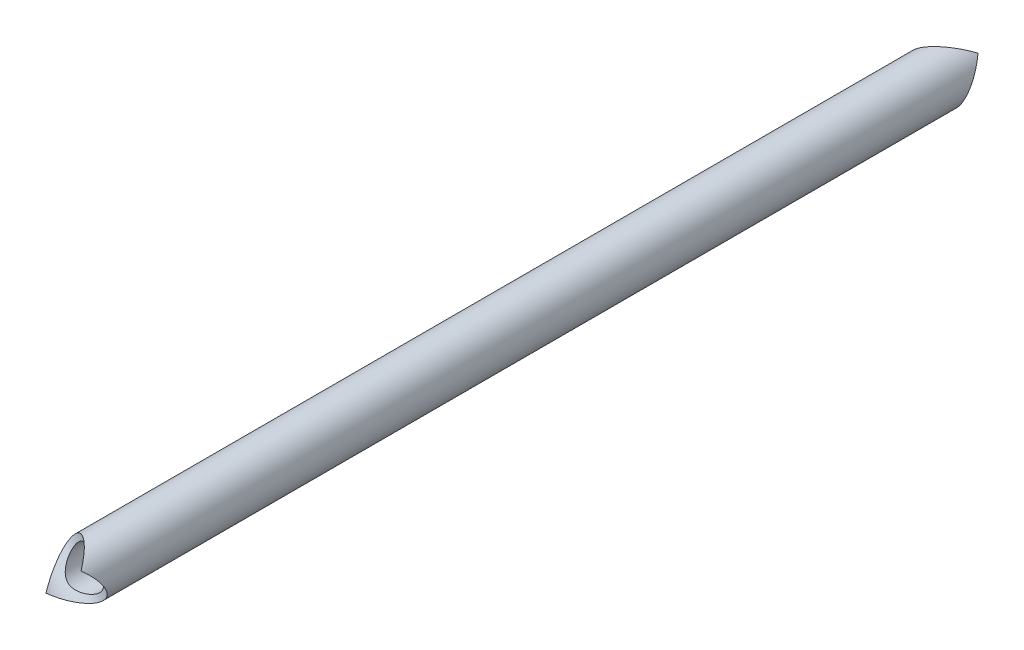
ISO-10303-21;
HEADER;
FILE_DESCRIPTION(('STEP AP214'),'2;1');
FILE_NAME('part.step','',(''),(''),'','','');
FILE_SCHEMA(('AUTOMOTIVE_DESIGN { 1 0 10303 214 1 1 1 1 }'));
ENDSEC;
DATA;
#1=APPLICATION_CONTEXT('core data for automotive mechanical design processes');
#2=APPLICATION_PROTOCOL_DEFINITION('international standard','automotive_design',2000,#1);
#3=PRODUCT_CONTEXT('',#1,'mechanical');
#4=PRODUCT('Part','Part','',(#3));
#5=PRODUCT_RELATED_PRODUCT_CATEGORY('part','',(#4));
#6=PRODUCT_DEFINITION_FORMATION('','',#4);
#7=PRODUCT_DEFINITION_CONTEXT('part definition',#1,'design');
#8=PRODUCT_DEFINITION('design','',#6,#7);
#9=PRODUCT_DEFINITION_SHAPE('','',#8);
#10=(LENGTH_UNIT() NAMED_UNIT(*) SI_UNIT(.MILLI.,.METRE.));
#11=(NAMED_UNIT(*) PLANE_ANGLE_UNIT() SI_UNIT($,.RADIAN.));
#12=(NAMED_UNIT(*) SI_UNIT($,.STERADIAN.) SOLID_ANGLE_UNIT());
#13=UNCERTAINTY_MEASURE_WITH_UNIT(LENGTH_MEASURE(1.E-05),#10,'distance_accuracy_value','');
#14=(GEOMETRIC_REPRESENTATION_CONTEXT(3) GLOBAL_UNCERTAINTY_ASSIGNED_CONTEXT((#13)) GLOBAL_UNIT_ASSIGNED_CONTEXT((#10,
#11,#12)) REPRESENTATION_CONTEXT('',''));
#15=CARTESIAN_POINT('',(0.,0.,0.));
#16=DIRECTION('',(0.,0.,1.));
#17=DIRECTION('',(1.,0.,0.));
#18=AXIS2_PLACEMENT_3D('',#15,#16,#17);
#19=CARTESIAN_POINT('',(2364.73313789473,514.219766290026,-224.530173537895));
#20=DIRECTION('',(0.,0.,1.));
#21=DIRECTION('',(1.,0.,0.));
#22=AXIS2_PLACEMENT_3D('',#19,#20,#21);
#23=CYLINDRICAL_SURFACE('',#22,9.64999999999982);
#24=CARTESIAN_POINT('',(2374.38313789473,514.219766290025,214.670255781294));
#25=CARTESIAN_POINT('',(2374.38313808255,514.48201971603,214.760425362817));
#26=CARTESIAN_POINT('',(2374.37245226315,514.74390513474,214.851658796265));
#27=CARTESIAN_POINT('',(2374.32981875689,515.266132938578,215.03391829087));
#28=CARTESIAN_POINT('',(2374.29786246496,515.526474656171,215.124944253132));
#29=CARTESIAN_POINT('',(2374.21258641161,516.045065522865,215.304195289557));
#30=CARTESIAN_POINT('',(2374.15923500596,516.303310991743,215.392416005119));
#31=CARTESIAN_POINT('',(2374.03098030421,516.816402016813,215.562765211823));
#32=CARTESIAN_POINT('',(2373.95608393449,517.071248638173,215.644895650239));
#33=CARTESIAN_POINT('',(2373.80328011211,517.521035627229,215.782429872911));
#34=CARTESIAN_POINT('',(2373.72964225494,517.716846645342,215.839743057099));
#35=CARTESIAN_POINT('',(2373.56891839295,518.105071506958,215.946408625565));
#36=CARTESIAN_POINT('',(2373.48183595112,518.297486235511,215.995763111938));
#37=CARTESIAN_POINT('',(2373.29437103687,518.677635494648,216.084243225108));
#38=CARTESIAN_POINT('',(2373.19401817692,518.865379371022,216.123391065975));
#39=CARTESIAN_POINT('',(2372.98004275199,519.235411706149,216.189342593095));
#40=CARTESIAN_POINT('',(2372.86642297691,519.417701301788,216.216148868807));
#41=CARTESIAN_POINT('',(2372.64549588637,519.746965326182,216.252226608424));
#42=CARTESIAN_POINT('',(2372.54004524568,519.894955553623,216.263604761974));
#43=CARTESIAN_POINT('',(2372.32071746326,520.185013980812,216.275157779931));
#44=CARTESIAN_POINT('',(2372.20684131261,520.327082874021,216.275333959931));
#45=CARTESIAN_POINT('',(2371.97153923492,520.60420593151,216.263871779228));
#46=CARTESIAN_POINT('',(2371.85011727051,520.739263710368,216.252239571216));
#47=CARTESIAN_POINT('',(2371.60068369811,521.001511500123,216.217043685097));
#48=CARTESIAN_POINT('',(2371.47267188028,521.128701260198,216.193479626839));
#49=CARTESIAN_POINT('',(2371.21158563812,521.374079855179,216.134887878899));
#50=CARTESIAN_POINT('',(2371.07852882691,521.492296332405,216.099897315335));
#51=CARTESIAN_POINT('',(2370.80801113251,521.719745783443,216.019240372173));
#52=CARTESIAN_POINT('',(2370.67054842432,521.828974965948,215.973569517974));
#53=CARTESIAN_POINT('',(2370.25273850926,522.143012543982,215.822033555208));
#54=CARTESIAN_POINT('',(2369.96711599436,522.334034674315,215.701679616841));
#55=CARTESIAN_POINT('',(2369.45114760468,522.641918524382,215.462102167777));
#56=CARTESIAN_POINT('',(2369.22232100826,522.765869648958,215.348348707594));
#57=CARTESIAN_POINT('',(2368.7608468601,522.992801167675,215.108037213251));
#58=CARTESIAN_POINT('',(2368.52819721108,523.095769605731,214.981471939958));
#59=CARTESIAN_POINT('',(2368.05948327602,523.281867544555,214.719238147483));
#60=CARTESIAN_POINT('',(2367.82341280292,523.364954577009,214.583550920654));
#61=CARTESIAN_POINT('',(2367.34865900657,523.511874219911,214.30660201296));
#62=CARTESIAN_POINT('',(2367.10997610416,523.575709885626,214.165341220669));
#63=CARTESIAN_POINT('',(2366.61807465916,523.687409652716,213.87283339981));
#64=CARTESIAN_POINT('',(2366.36472603522,523.73431560252,213.721440208481));
#65=CARTESIAN_POINT('',(2365.85530579232,523.807751565453,213.418254098226));
#66=CARTESIAN_POINT('',(2365.59923395139,523.834279904482,213.266461147485));
#67=CARTESIAN_POINT('',(2365.08477989803,523.866797631237,212.96511398704));
#68=CARTESIAN_POINT('',(2364.82639997138,523.872805475295,212.815557886115));
#69=CARTESIAN_POINT('',(2364.30745144093,523.863864043597,212.520937501229));
#70=CARTESIAN_POINT('',(2364.0468830773,523.848917038386,212.375872732356));
#71=CARTESIAN_POINT('',(2363.54743321558,523.799632101498,212.105249445946));
#72=CARTESIAN_POINT('',(2363.30868830028,523.767140812126,211.979104634793));
#73=CARTESIAN_POINT('',(2362.83053432901,523.683460051141,211.734404257281));
#74=CARTESIAN_POINT('',(2362.59112525828,523.632270160567,211.615848861042));
#75=CARTESIAN_POINT('',(2362.11286449719,523.510487590107,211.388436715519));
#76=CARTESIAN_POINT('',(2361.87401250268,523.439911889878,211.279571588694));
#77=CARTESIAN_POINT('',(2361.39805278381,523.27861837228,211.073558271176));
#78=CARTESIAN_POINT('',(2361.16094467039,523.187905197536,210.976407387757));
#79=CARTESIAN_POINT('',(2360.73647309743,523.005638492636,210.813725584907));
#80=CARTESIAN_POINT('',(2360.548479185,522.917743563572,210.74573091353));
#81=CARTESIAN_POINT('',(2360.17593362559,522.728468872491,210.619876570796));
#82=CARTESIAN_POINT('',(2359.99138124375,522.627092027726,210.562014713132));
#83=CARTESIAN_POINT('',(2359.62710399681,522.410965225827,210.457538598417));
#84=CARTESIAN_POINT('',(2359.44737650749,522.296222727224,210.410918112438));
#85=CARTESIAN_POINT('',(2359.09409119265,522.053638831572,210.32986080176));
#86=CARTESIAN_POINT('',(2358.92053342094,521.925797320306,210.29542408331));
#87=CARTESIAN_POINT('',(2358.58017497507,521.656892074673,210.239367403501));
#88=CARTESIAN_POINT('',(2358.41341715959,521.515758880146,210.217819652277));
#89=CARTESIAN_POINT('',(2358.08922763093,521.221825012009,210.188370362252));
#90=CARTESIAN_POINT('',(2357.93179591887,521.069024336977,210.180468825117));
#91=CARTESIAN_POINT('',(2357.6276949412,520.753009239834,210.178512127246));
#92=CARTESIAN_POINT('',(2357.48102469763,520.589795766519,210.184455706717));
#93=CARTESIAN_POINT('',(2357.19963849445,520.25439965138,210.21003656234));
#94=CARTESIAN_POINT('',(2357.06492203838,520.082217382528,210.229673269478));
#95=CARTESIAN_POINT('',(2356.81930743665,519.745474582111,210.279910432109));
#96=CARTESIAN_POINT('',(2356.70735780792,519.581516476386,210.309432968344));
#97=CARTESIAN_POINT('',(2356.494646227,519.248562975747,210.378957927159));
#98=CARTESIAN_POINT('',(2356.39388848574,519.079565714988,210.418964275374));
#99=CARTESIAN_POINT('',(2356.2038723123,518.737770551765,210.508721826642));
#100=CARTESIAN_POINT('',(2356.11461314256,518.564972893905,210.558472404153));
#101=CARTESIAN_POINT('',(2355.94763466201,518.216610387768,210.666898006111));
#102=CARTESIAN_POINT('',(2355.86991766564,518.041044992289,210.725574815693));
#103=CARTESIAN_POINT('',(2355.70105333054,517.62706956538,210.872662516414));
#104=CARTESIAN_POINT('',(2355.61455029353,517.38791472572,210.964340282697));
#105=CARTESIAN_POINT('',(2355.46177857228,516.908225419553,211.160099620706));
#106=CARTESIAN_POINT('',(2355.39551572714,516.667690575278,211.264184759826));
#107=CARTESIAN_POINT('',(2355.28239967269,516.186308458115,211.482820693324));
#108=CARTESIAN_POINT('',(2355.23558143319,515.945461397076,211.597389895056));
#109=CARTESIAN_POINT('',(2355.16072624176,515.464982846506,211.834804890819));
#110=CARTESIAN_POINT('',(2355.13268970129,515.22535138372,211.957650866116));
#111=CARTESIAN_POINT('',(2355.0889441113,514.676674800974,212.247418530725));
#112=CARTESIAN_POINT('',(2355.07942417428,514.368289906157,212.416539639557));
#113=CARTESIAN_POINT('',(2355.08942963626,513.755798538593,212.761634429635));
#114=CARTESIAN_POINT('',(2355.10896592121,513.451693712471,212.937610655099));
#115=CARTESIAN_POINT('',(2355.17628734733,512.848125071221,213.292632586706));
#116=CARTESIAN_POINT('',(2355.22409599772,512.548665331517,213.471680726781));
#117=CARTESIAN_POINT('',(2355.34777296357,511.954956855995,213.828567383006));
#118=CARTESIAN_POINT('',(2355.4236323176,511.660706487353,214.006406267022));
#119=CARTESIAN_POINT('',(2355.58291892675,511.145562921765,214.315427692397));
#120=CARTESIAN_POINT('',(2355.6604568431,510.923563491889,214.44781997414));
#121=CARTESIAN_POINT('',(2355.83292484589,510.48282770922,214.706694388622));
#122=CARTESIAN_POINT('',(2355.92785549193,510.264091461664,214.833176331032));
#123=CARTESIAN_POINT('',(2356.13564175984,509.830784177825,215.076991446349));
#124=CARTESIAN_POINT('',(2356.2484556142,509.616204712152,215.194345010013));
#125=CARTESIAN_POINT('',(2356.4930502874,509.191501860313,215.416722305924));
#126=CARTESIAN_POINT('',(2356.62482331457,508.981376684069,215.521751071262));
#127=CARTESIAN_POINT('',(2356.86760597176,508.626195168841,215.687829083658));
#128=CARTESIAN_POINT('',(2356.97379072109,508.479701109726,215.752870042953));
#129=CARTESIAN_POINT('',(2357.19633313074,508.190475671762,215.873119278664));
#130=CARTESIAN_POINT('',(2357.31268762065,508.047743138192,215.928330603274));
#131=CARTESIAN_POINT('',(2357.55531297331,507.767195927053,216.027426471761));
#132=CARTESIAN_POINT('',(2357.68156921727,507.6293744207,216.071327318395));
#133=CARTESIAN_POINT('',(2357.94372826446,507.359607260369,216.146724028708));
#134=CARTESIAN_POINT('',(2358.07963094943,507.227661534397,216.178220044413));
#135=CARTESIAN_POINT('',(2358.36105065391,506.970245541346,216.228200743074));
#136=CARTESIAN_POINT('',(2358.50661396888,506.844812491252,216.246616954905));
#137=CARTESIAN_POINT('',(2358.80563582888,506.602400315216,216.27002966125));
#138=CARTESIAN_POINT('',(2358.9590942754,506.485421083835,216.275026323164));
#139=CARTESIAN_POINT('',(2359.27283617522,506.26081723206,216.272098525308));
#140=CARTESIAN_POINT('',(2359.43312714505,506.153203332091,216.264159457828));
#141=CARTESIAN_POINT('',(2359.75911823965,505.94820514366,216.236380977142));
#142=CARTESIAN_POINT('',(2359.92481911374,505.850822280232,216.216539908739));
#143=CARTESIAN_POINT('',(2360.29483095667,505.647888532291,216.161224279869));
#144=CARTESIAN_POINT('',(2360.50010635429,505.544741690832,216.123381994854));
#145=CARTESIAN_POINT('',(2360.91521708808,505.354204629792,216.035224651879));
#146=CARTESIAN_POINT('',(2361.12505347454,505.266818083441,215.984906692706));
#147=CARTESIAN_POINT('',(2361.54846463321,505.10759774409,215.874445638037));
#148=CARTESIAN_POINT('',(2361.76204585167,505.035794362801,215.814283725404));
#149=CARTESIAN_POINT('',(2362.19166810293,504.907747786383,215.686739742833));
#150=CARTESIAN_POINT('',(2362.40770927128,504.85150545314,215.619357273255));
#151=CARTESIAN_POINT('',(2362.90364314756,504.740463583915,215.459642508764));
#152=CARTESIAN_POINT('',(2363.18413953652,504.690669515995,215.365683121378));
#153=CARTESIAN_POINT('',(2363.74705987952,504.616079999536,215.173633321692));
#154=CARTESIAN_POINT('',(2364.02948428533,504.591290627621,215.075541911261));
#155=CARTESIAN_POINT('',(2364.59525269075,504.566597509493,214.878684738431));
#156=CARTESIAN_POINT('',(2364.87859686656,504.566698851929,214.779918842269));
#157=CARTESIAN_POINT('',(2365.44497827439,504.591883600489,214.584767446744));
#158=CARTESIAN_POINT('',(2365.72801553078,504.616964851931,214.488381742808));
#159=CARTESIAN_POINT('',(2366.29377604089,504.69250393374,214.300252892088));
#160=CARTESIAN_POINT('',(2366.57649151412,504.743080921871,214.208533792038));
#161=CARTESIAN_POINT('',(2367.13856856193,504.869932275001,214.032760431236));
#162=CARTESIAN_POINT('',(2367.41793001813,504.946207544111,213.948706440289));
#163=CARTESIAN_POINT('',(2367.97094529835,505.124524994486,213.790700051386));
#164=CARTESIAN_POINT('',(2368.24460451495,505.226541512046,213.716737704682));
#165=CARTESIAN_POINT('',(2368.78404524283,505.456288108977,213.580982609766));
#166=CARTESIAN_POINT('',(2369.04982792917,505.584014330413,213.519188038435));
#167=CARTESIAN_POINT('',(2369.54637031749,505.851539851425,213.414795818491));
#168=CARTESIAN_POINT('',(2369.77807906088,505.989088645695,213.3709424081));
#169=CARTESIAN_POINT('',(2370.23058611336,506.284181964992,213.2959609031));
#170=CARTESIAN_POINT('',(2370.45138504309,506.44172535074,213.264832083878));
#171=CARTESIAN_POINT('',(2370.87966674849,506.775550809529,213.216192305887));
#172=CARTESIAN_POINT('',(2371.08715976277,506.951818190538,213.198670758415));
#173=CARTESIAN_POINT('',(2371.4868574665,507.321659386359,213.177715484194));
#174=CARTESIAN_POINT('',(2371.67906389062,507.515231232227,213.174280156759));
#175=CARTESIAN_POINT('',(2372.02221571804,507.891422606561,213.181108539665));
#176=CARTESIAN_POINT('',(2372.17526892982,508.072159684562,213.189638137785));
#177=CARTESIAN_POINT('',(2372.46732571385,508.443894123112,213.217212373858));
#178=CARTESIAN_POINT('',(2372.60632941587,508.634891388876,213.23625691469));
#179=CARTESIAN_POINT('',(2372.86945216446,509.025692989288,213.284453338978));
#180=CARTESIAN_POINT('',(2372.99356872683,509.225498786209,213.313606906156));
#181=CARTESIAN_POINT('',(2373.2262805505,509.632396387518,213.381408263322));
#182=CARTESIAN_POINT('',(2373.33487545982,509.839488356999,213.420056268557));
#183=CARTESIAN_POINT('',(2373.53606550226,510.259323015838,213.506030786875));
#184=CARTESIAN_POINT('',(2373.62867383039,510.472060876221,213.553350075693));
#185=CARTESIAN_POINT('',(2373.79781258301,510.902003966678,213.65578138832));
#186=CARTESIAN_POINT('',(2373.87434194327,511.11920949141,213.710893927538));
#187=CARTESIAN_POINT('',(2374.01122578373,511.55667107017,213.827853070974));
#188=CARTESIAN_POINT('',(2374.07159252778,511.776924677152,213.889694519047));
#189=CARTESIAN_POINT('',(2374.1762914779,512.21950169091,214.019040517443));
#190=CARTESIAN_POINT('',(2374.22062658574,512.441824715638,214.086544040195));
#191=CARTESIAN_POINT('',(2374.29921570531,512.923151551679,214.237185020368));
#192=CARTESIAN_POINT('',(2374.33074072643,513.182359651215,214.321100445317));
#193=CARTESIAN_POINT('',(2374.37270212978,513.701087048397,214.493082768008));
#194=CARTESIAN_POINT('',(2374.38313770911,513.960606357515,214.581149823679));
#195=CARTESIAN_POINT('',(2374.38313789473,514.219766290025,214.670255781294));
#196=B_SPLINE_CURVE_WITH_KNOTS('',3,(#24,#25,#26,#27,#28,#29,#30,#31,#32,#33,#34,#35,#36,#37,
#38,#39,#40,#41,#42,#43,#44,#45,#46,#47,#48,#49,#50,#51,#52,#53,#54,#55,#56,#57,#58,#59,#60,#61,
#62,#63,#64,#65,#66,#67,#68,#69,#70,#71,#72,#73,#74,#75,#76,#77,#78,#79,#80,#81,#82,#83,#84,#85,
#86,#87,#88,#89,#90,#91,#92,#93,#94,#95,#96,#97,#98,#99,#100,#101,#102,#103,#104,#105,#106,#107,
#108,#109,#110,#111,#112,#113,#114,#115,#116,#117,#118,#119,#120,#121,#122,#123,#124,#125,#126,
#127,#128,#129,#130,#131,#132,#133,#134,#135,#136,#137,#138,#139,#140,#141,#142,#143,#144,#145,
#146,#147,#148,#149,#150,#151,#152,#153,#154,#155,#156,#157,#158,#159,#160,#161,#162,#163,#164,
#165,#166,#167,#168,#169,#170,#171,#172,#173,#174,#175,#176,#177,#178,#179,#180,#181,#182,#183,
#184,#185,#186,#187,#188,#189,#190,#191,#192,#193,#194,#195),.UNSPECIFIED.,.T.,.F.,(4,2,2,2,2,2,
2,2,2,2,2,2,2,2,2,2,2,2,2,2,2,2,2,2,2,2,2,2,2,2,2,2,2,2,2,2,2,2,2,2,2,2,2,2,2,2,2,2,2,2,2,2,2,2,
2,2,2,2,2,2,2,2,2,2,2,2,2,2,2,2,2,2,2,2,2,2,2,2,2,2,2,2,2,2,2,4),(0.,0.831761280052768,
1.66385925787008,2.49719250832365,3.33025815396322,3.9804627112926,4.63049525073005,
5.27910100023827,5.92757059973964,6.47319633261907,7.01875798546877,7.5640355224907,
8.10933043323529,8.6528709541894,9.19663960545785,10.2847794545238,11.1357730011244,
11.9872501023101,12.8405301085215,13.6936746244359,14.5894757627196,15.4853504866729,
16.3804192397464,17.2753910159167,18.0906106894699,18.9058486299773,19.7203747837953,
20.534713346094,21.1892391171388,21.8436234898697,22.4976444256779,23.1516710647698,
23.8093283641287,24.4669857437052,25.1245832841365,25.7821534999249,26.3836406449066,
26.985353337724,27.5870274154919,28.1888219790781,28.9986469216497,29.8087052708786,
30.6202142127726,31.4317409329537,32.48582202543,33.5402981298181,34.595652294808,
35.6506695941895,36.4596789037737,37.2687142476383,38.0758871407183,38.8827292520713,
39.4590406361754,40.0351729921689,40.6104702137641,41.1857603845492,41.7640403624498,
42.342313126656,42.9212393597495,43.5002461221595,44.1976931848508,44.8953025910443,
45.5942614296343,46.2932589739373,47.1920123401149,48.0909840681271,48.990139581771,
49.8892175440759,50.7925369757319,51.6958881911005,52.5983423107377,53.5006611110653,
54.3184862440782,55.13626479885,55.9534063476211,56.7704550381256,57.4805666180139,
58.1906716390724,58.9008949895165,59.6111344428115,60.3207848460185,61.030482204221,
61.7396395238841,62.4486684205541,63.2705871055722,64.092537081544),.UNSPECIFIED.);
#197=CARTESIAN_POINT('',(2374.38313789473,514.219766290025,214.670255781294));
#198=VERTEX_POINT('',#197);
#199=EDGE_CURVE('E88',#198,#198,#196,.T.);
#200=ORIENTED_EDGE('',*,*,#199,.T.);
#201=EDGE_LOOP('',(#200));
#202=FACE_BOUND('',#201,.T.);
#203=CARTESIAN_POINT('',(2374.38313789472,514.219766290026,-214.670255781295));
#204=CARTESIAN_POINT('',(2374.38313762026,513.962217646412,-214.581705070565));
#205=CARTESIAN_POINT('',(2374.37282999265,513.704292595588,-214.494171066323));
#206=CARTESIAN_POINT('',(2374.33138487933,513.188727825646,-214.323186743601));
#207=CARTESIAN_POINT('',(2374.30024526863,512.931088138323,-214.239736842658));
#208=CARTESIAN_POINT('',(2374.21685983832,512.417182182849,-214.078766150041));
#209=CARTESIAN_POINT('',(2374.16460181781,512.160916795554,-214.00124881668));
#210=CARTESIAN_POINT('',(2374.03877639277,511.651414377186,-213.853976917283));
#211=CARTESIAN_POINT('',(2373.96521164504,511.398176972642,-213.784221384905));
#212=CARTESIAN_POINT('',(2373.79614530229,510.894811199666,-213.653689990975));
#213=CARTESIAN_POINT('',(2373.70050615947,510.644713151657,-213.592974534192));
#214=CARTESIAN_POINT('',(2373.48769271276,510.151296533314,-213.482584322771));
#215=CARTESIAN_POINT('',(2373.37051799373,509.907978093778,-213.432909781011));
#216=CARTESIAN_POINT('',(2373.11520441509,509.430541529666,-213.345956491893));
#217=CARTESIAN_POINT('',(2372.97708387569,509.196415588012,-213.308667002038));
#218=CARTESIAN_POINT('',(2372.68065398476,508.73947210038,-213.247466394648));
#219=CARTESIAN_POINT('',(2372.52234713493,508.516653157896,-213.223553621306));
#220=CARTESIAN_POINT('',(2372.20404646772,508.106806148924,-213.191521791636));
#221=CARTESIAN_POINT('',(2372.04589348642,507.91845187672,-213.182033611495));
#222=CARTESIAN_POINT('',(2371.71554075849,507.554259784722,-213.174599310804));
#223=CARTESIAN_POINT('',(2371.54334204601,507.378421045233,-213.176652341267));
#224=CARTESIAN_POINT('',(2371.18631723382,507.040674366597,-213.192250037943));
#225=CARTESIAN_POINT('',(2371.00149259984,506.87876481535,-213.205793372343));
#226=CARTESIAN_POINT('',(2370.62075009616,506.570021666961,-213.244049547772));
#227=CARTESIAN_POINT('',(2370.42483231211,506.423187953469,-213.268762302591));
#228=CARTESIAN_POINT('',(2370.03446014536,506.153061263319,-213.327151662112));
#229=CARTESIAN_POINT('',(2369.84050544595,506.028922394664,-213.360267792353));
#230=CARTESIAN_POINT('',(2369.44543727923,505.795432145992,-213.435331553858));
#231=CARTESIAN_POINT('',(2369.24432098636,505.686086686155,-213.477282703743));
#232=CARTESIAN_POINT('',(2368.8363869327,505.482616177422,-213.569197554258));
#233=CARTESIAN_POINT('',(2368.62957063963,505.388487252437,-213.619159207903));
#234=CARTESIAN_POINT('',(2368.21140533993,505.21558073854,-213.726197868016));
#235=CARTESIAN_POINT('',(2368.00005586447,505.136804746045,-213.783275613414));
#236=CARTESIAN_POINT('',(2367.55694849576,504.988980355912,-213.908351991979));
#237=CARTESIAN_POINT('',(2367.32490783975,504.921209780419,-213.976858631426));
#238=CARTESIAN_POINT('',(2366.85810221928,504.803558098165,-214.119665567095));
#239=CARTESIAN_POINT('',(2366.62333713015,504.75367781342,-214.193966129342));
#240=CARTESIAN_POINT('',(2366.15191519791,504.671631818347,-214.347006314784));
#241=CARTESIAN_POINT('',(2365.91525672993,504.639483471816,-214.4257502062));
#242=CARTESIAN_POINT('',(2365.44116374588,504.592827730155,-214.586084929231));
#243=CARTESIAN_POINT('',(2365.2037291704,504.578321719082,-214.667675983692));
#244=CARTESIAN_POINT('',(2364.69407733756,504.566004426387,-214.844093433815));
#245=CARTESIAN_POINT('',(2364.42185561271,504.570947431134,-214.939109116306));
#246=CARTESIAN_POINT('',(2363.87833595613,504.603844102184,-215.127978015811));
#247=CARTESIAN_POINT('',(2363.60703823625,504.631802729663,-215.221830977765));
#248=CARTESIAN_POINT('',(2363.06643282289,504.710865140636,-215.40515402914));
#249=CARTESIAN_POINT('',(2362.7971244418,504.761960506094,-215.494625699535));
#250=CARTESIAN_POINT('',(2362.26146283816,504.887620449772,-215.665487598949));
#251=CARTESIAN_POINT('',(2361.99510851918,504.962175996739,-215.746880921982));
#252=CARTESIAN_POINT('',(2361.54166153971,505.110615380584,-215.875873094409));
#253=CARTESIAN_POINT('',(2361.35352028048,505.178688998008,-215.926508399832));
#254=CARTESIAN_POINT('',(2360.98012459096,505.327199886525,-216.019555211017));
#255=CARTESIAN_POINT('',(2360.79486935331,505.407633628898,-216.061969056151));
#256=CARTESIAN_POINT('',(2360.42843537302,505.580726262304,-216.136587372012));
#257=CARTESIAN_POINT('',(2360.24724988306,505.673362851281,-216.168810111267));
#258=CARTESIAN_POINT('',(2359.88976820698,505.870757606587,-216.22123914398));
#259=CARTESIAN_POINT('',(2359.71347195389,505.975515606766,-216.241445602122));
#260=CARTESIAN_POINT('',(2359.36533660925,506.197778039186,-216.268298271844));
#261=CARTESIAN_POINT('',(2359.19356444985,506.315405655682,-216.274798683452));
#262=CARTESIAN_POINT('',(2358.85805210358,506.561493646984,-216.272583288594));
#263=CARTESIAN_POINT('',(2358.69431154229,506.689953516036,-216.263868192161));
#264=CARTESIAN_POINT('',(2358.37640599603,506.956332779221,-216.230777450841));
#265=CARTESIAN_POINT('',(2358.2222404384,507.094251606584,-216.206402743528));
#266=CARTESIAN_POINT('',(2357.92472263816,507.377965237866,-216.142419132459));
#267=CARTESIAN_POINT('',(2357.78137031895,507.523759985989,-216.102810336614));
#268=CARTESIAN_POINT('',(2357.5246177466,507.801773401673,-216.015774300986));
#269=CARTESIAN_POINT('',(2357.40977142662,507.933213195948,-215.970091577013));
#270=CARTESIAN_POINT('',(2357.18899660719,508.199930265043,-215.869267918267));
#271=CARTESIAN_POINT('',(2357.08307123699,508.335208864366,-215.814123685043));
#272=CARTESIAN_POINT('',(2356.77864823792,508.745766271832,-215.636268387651));
#273=CARTESIAN_POINT('',(2356.59354463444,509.025721904646,-215.501149381799));
#274=CARTESIAN_POINT('',(2356.28243803253,509.552044013383,-215.229351631508));
#275=CARTESIAN_POINT('',(2356.1517514498,509.797341564656,-215.095785409537));
#276=CARTESIAN_POINT('',(2355.9139716091,510.292893760994,-214.816993190429));
#277=CARTESIAN_POINT('',(2355.80689311313,510.543151401598,-214.671759974971));
#278=CARTESIAN_POINT('',(2355.61508016364,511.048524038954,-214.373695470019));
#279=CARTESIAN_POINT('',(2355.53040242333,511.303649643947,-214.220846037835));
#280=CARTESIAN_POINT('',(2355.3829992314,511.817907630211,-213.911514296611));
#281=CARTESIAN_POINT('',(2355.3202695747,512.077039234019,-213.7550326896));
#282=CARTESIAN_POINT('',(2355.21415692622,512.610797563506,-213.434547159374));
#283=CARTESIAN_POINT('',(2355.17175174043,512.885602884321,-213.270516492038));
#284=CARTESIAN_POINT('',(2355.11071286395,513.43936392138,-212.944937927786));
#285=CARTESIAN_POINT('',(2355.09208242598,513.718320200252,-212.78339037358));
#286=CARTESIAN_POINT('',(2355.07924963614,514.27945814618,-212.466080592123));
#287=CARTESIAN_POINT('',(2355.08500529287,514.561633435115,-212.310308885546));
#288=CARTESIAN_POINT('',(2355.1218565709,515.128888858432,-212.007316241499));
#289=CARTESIAN_POINT('',(2355.15294464684,515.413968102895,-211.860092771887));
#290=CARTESIAN_POINT('',(2355.2315599813,515.92045373624,-211.609686037618));
#291=CARTESIAN_POINT('',(2355.27370835709,516.141526154045,-211.504125962705));
#292=CARTESIAN_POINT('',(2355.37444415578,516.583824475876,-211.30155613144));
#293=CARTESIAN_POINT('',(2355.43302758221,516.805050329562,-211.204544303963));
#294=CARTESIAN_POINT('',(2355.56716507265,517.24641362196,-211.020766966979));
#295=CARTESIAN_POINT('',(2355.64270507765,517.466551808819,-210.933993059444));
#296=CARTESIAN_POINT('',(2355.81124199127,517.904503985716,-210.772295989845));
#297=CARTESIAN_POINT('',(2355.90423617784,518.122318332575,-210.697370983262));
#298=CARTESIAN_POINT('',(2356.09212772318,518.520478170532,-210.571596480262));
#299=CARTESIAN_POINT('',(2356.18450305098,518.701405326176,-210.518815554613));
#300=CARTESIAN_POINT('',(2356.38180887287,519.059136928165,-210.423865249002));
#301=CARTESIAN_POINT('',(2356.48673695883,519.235942157511,-210.381693838505));
#302=CARTESIAN_POINT('',(2356.70883010971,519.584054658543,-210.308805354383));
#303=CARTESIAN_POINT('',(2356.82598992324,519.755364248687,-210.278083390897));
#304=CARTESIAN_POINT('',(2357.07204602649,520.091179696877,-210.228725041655));
#305=CARTESIAN_POINT('',(2357.20094243358,520.255685486854,-210.210088776782));
#306=CARTESIAN_POINT('',(2357.47007087347,520.576998768884,-210.185286526985));
#307=CARTESIAN_POINT('',(2357.61033583741,520.733781616127,-210.179158221099));
#308=CARTESIAN_POINT('',(2357.90080849206,521.037829044054,-210.179627867506));
#309=CARTESIAN_POINT('',(2358.05101619647,521.18509361162,-210.186225837337));
#310=CARTESIAN_POINT('',(2358.36015106772,521.469013932484,-210.211995290921));
#311=CARTESIAN_POINT('',(2358.51907928907,521.605668397942,-210.231168298355));
#312=CARTESIAN_POINT('',(2358.84429015418,521.867481776524,-210.281654711994));
#313=CARTESIAN_POINT('',(2359.01057277646,521.992640723257,-210.312968082702));
#314=CARTESIAN_POINT('',(2359.34193533242,522.225809564812,-210.385489128747));
#315=CARTESIAN_POINT('',(2359.50676744104,522.334321514299,-210.426221105657));
#316=CARTESIAN_POINT('',(2359.84081923505,522.539995233358,-210.517472324799));
#317=CARTESIAN_POINT('',(2360.0100405552,522.637152697596,-210.567995260339));
#318=CARTESIAN_POINT('',(2360.35175890908,522.819974038073,-210.677983458914));
#319=CARTESIAN_POINT('',(2360.52425625971,522.905636795828,-210.737449590967));
#320=CARTESIAN_POINT('',(2360.87158558583,523.065527082075,-210.864434853117));
#321=CARTESIAN_POINT('',(2361.04641804415,523.139752204526,-210.931955672325));
#322=CARTESIAN_POINT('',(2361.47276677664,523.306291032919,-211.104586772687));
#323=CARTESIAN_POINT('',(2361.72508013657,523.392751617428,-211.213417418863));
#324=CARTESIAN_POINT('',(2362.23089207762,523.54344429819,-211.443087066357));
#325=CARTESIAN_POINT('',(2362.48439106488,523.607668109905,-211.563930521638));
#326=CARTESIAN_POINT('',(2362.99150561664,523.714842909317,-211.815342379276));
#327=CARTESIAN_POINT('',(2363.24512079433,523.757762134659,-211.945924970039));
#328=CARTESIAN_POINT('',(2363.75108488192,523.823054457556,-212.214332760803));
#329=CARTESIAN_POINT('',(2364.00343390225,523.845429378925,-212.352157316754));
#330=CARTESIAN_POINT('',(2364.51158116302,523.870646762895,-212.635844778325));
#331=CARTESIAN_POINT('',(2364.76733936904,523.873065810471,-212.781816074769));
#332=CARTESIAN_POINT('',(2365.27651149514,523.857822528948,-213.076773261114));
#333=CARTESIAN_POINT('',(2365.52992525046,523.840158799197,-213.225759360568));
#334=CARTESIAN_POINT('',(2366.03421106558,523.785018967126,-213.524429056378));
#335=CARTESIAN_POINT('',(2366.28508279358,523.747540311596,-213.674112740156));
#336=CARTESIAN_POINT('',(2366.78413081808,523.652710584244,-213.971644225745));
#337=CARTESIAN_POINT('',(2367.03230738949,523.595361559344,-214.119492215034));
#338=CARTESIAN_POINT('',(2367.49868021345,523.467798244886,-214.394474042642));
#339=CARTESIAN_POINT('',(2367.71716689798,523.399697674339,-214.522095332815));
#340=CARTESIAN_POINT('',(2368.15181907002,523.2468473562,-214.771303515908));
#341=CARTESIAN_POINT('',(2368.36798437802,523.16209633076,-214.892889944781));
#342=CARTESIAN_POINT('',(2368.79725654218,522.975343923811,-215.127043595127));
#343=CARTESIAN_POINT('',(2369.01036786135,522.873371274148,-215.239625385965));
#344=CARTESIAN_POINT('',(2369.4332051046,522.65118794936,-215.452747375406));
#345=CARTESIAN_POINT('',(2369.64293108931,522.530977601233,-215.553287789852));
#346=CARTESIAN_POINT('',(2370.00208248668,522.306347038531,-215.713795068656));
#347=CARTESIAN_POINT('',(2370.15262145517,522.206313776556,-215.777418605892));
#348=CARTESIAN_POINT('',(2370.45029575732,521.995998312273,-215.894690883547));
#349=CARTESIAN_POINT('',(2370.5974330438,521.885722182267,-215.948345477976));
#350=CARTESIAN_POINT('',(2370.88716112271,521.655135620684,-216.044245693143));
#351=CARTESIAN_POINT('',(2371.0297583023,521.53484023266,-216.086508028683));
#352=CARTESIAN_POINT('',(2371.30943205006,521.284472271196,-216.158602962584));
#353=CARTESIAN_POINT('',(2371.44650869255,521.154399829489,-216.18843572838));
#354=CARTESIAN_POINT('',(2371.71447547112,520.884579918575,-216.235117601799));
#355=CARTESIAN_POINT('',(2371.8453336769,520.744790047302,-216.251905336655));
#356=CARTESIAN_POINT('',(2372.09891927205,520.457116033358,-216.272199720327));
#357=CARTESIAN_POINT('',(2372.22164671477,520.3092319438,-216.27570645628));
#358=CARTESIAN_POINT('',(2372.45808734306,520.006355856427,-216.269995330906));
#359=CARTESIAN_POINT('',(2372.5717880237,519.851354452083,-216.260760132381));
#360=CARTESIAN_POINT('',(2372.78925823768,519.535610322578,-216.230616195069));
#361=CARTESIAN_POINT('',(2372.89302527159,519.374866166377,-216.209704527352));
#362=CARTESIAN_POINT('',(2373.11177837626,519.012974696056,-216.151904255446));
#363=CARTESIAN_POINT('',(2373.22423495643,518.810697038575,-216.11251772029));
#364=CARTESIAN_POINT('',(2373.43336270363,518.400862238047,-216.021325233647));
#365=CARTESIAN_POINT('',(2373.53002942697,518.19330362773,-215.969515796119));
#366=CARTESIAN_POINT('',(2373.70768739179,517.77390348188,-215.856221925784));
#367=CARTESIAN_POINT('',(2373.78866043149,517.562057284203,-215.794726406931));
#368=CARTESIAN_POINT('',(2373.93496310397,517.13521077136,-215.664673874246));
#369=CARTESIAN_POINT('',(2374.00029406902,516.920210726471,-215.59611746252));
#370=CARTESIAN_POINT('',(2374.1121840475,516.500215983541,-215.458305670906));
#371=CARTESIAN_POINT('',(2374.15961042649,516.295362061492,-215.389320194346));
#372=CARTESIAN_POINT('',(2374.24089496931,515.883816119102,-215.24871604373));
#373=CARTESIAN_POINT('',(2374.27474939255,515.677123608047,-215.177096649667));
#374=CARTESIAN_POINT('',(2374.32891293033,515.262496308082,-215.032749573777));
#375=CARTESIAN_POINT('',(2374.34922999962,515.054562321294,-214.960022568545));
#376=CARTESIAN_POINT('',(2374.37634290092,514.637757067169,-214.814725532773));
#377=CARTESIAN_POINT('',(2374.38313811758,514.428885757612,-214.742155509526));
#378=CARTESIAN_POINT('',(2374.38313789472,514.219766290026,-214.670255781295));
#379=B_SPLINE_CURVE_WITH_KNOTS('',3,(#203,#204,#205,#206,#207,#208,#209,#210,#211,#212,#213,
#214,#215,#216,#217,#218,#219,#220,#221,#222,#223,#224,#225,#226,#227,#228,#229,#230,#231,#232,
#233,#234,#235,#236,#237,#238,#239,#240,#241,#242,#243,#244,#245,#246,#247,#248,#249,#250,#251,
#252,#253,#254,#255,#256,#257,#258,#259,#260,#261,#262,#263,#264,#265,#266,#267,#268,#269,#270,
#271,#272,#273,#274,#275,#276,#277,#278,#279,#280,#281,#282,#283,#284,#285,#286,#287,#288,#289,
#290,#291,#292,#293,#294,#295,#296,#297,#298,#299,#300,#301,#302,#303,#304,#305,#306,#307,#308,
#309,#310,#311,#312,#313,#314,#315,#316,#317,#318,#319,#320,#321,#322,#323,#324,#325,#326,#327,
#328,#329,#330,#331,#332,#333,#334,#335,#336,#337,#338,#339,#340,#341,#342,#343,#344,#345,#346,
#347,#348,#349,#350,#351,#352,#353,#354,#355,#356,#357,#358,#359,#360,#361,#362,#363,#364,#365,
#366,#367,#368,#369,#370,#371,#372,#373,#374,#375,#376,#377,#378),.UNSPECIFIED.,.T.,.F.,(4,2,2,
2,2,2,2,2,2,2,2,2,2,2,2,2,2,2,2,2,2,2,2,2,2,2,2,2,2,2,2,2,2,2,2,2,2,2,2,2,2,2,2,2,2,2,2,2,2,2,2,
2,2,2,2,2,2,2,2,2,2,2,2,2,2,2,2,2,2,2,2,2,2,2,2,2,2,2,2,2,2,2,2,2,2,2,2,4),(0.,
0.816876755718712,1.63383685059502,2.45126961057869,3.26860048623897,4.0911687109941,
4.91375279426744,5.7356215131235,6.55738847626187,7.29481101183151,8.03217930236928,
8.7694621381053,9.50673928332367,10.2039270857351,10.9013930758572,11.5986811203631,
12.2960416310873,13.0490487399936,13.8020904432822,14.5558682506974,15.3097051887918,
16.1738776207061,17.0382363796991,17.9022809040537,18.7659932111325,19.3846676610843,
20.0031658113156,20.620548876729,21.2379234806345,21.8618330294102,22.4857134641829,
23.1095565493489,23.7333952155665,24.2741266754806,24.8150470284784,25.8970732199002,
26.8210021740053,27.7455072279406,28.6723309736511,29.5989770498962,30.5665858054258,
31.5343269289766,32.5004023376832,33.4661901020189,34.2113158112999,34.9562604873943,
35.7005897832013,36.4448030949019,37.0738365194976,37.7027494627385,38.3313934993853,
38.9600438237305,39.5905851189632,40.221127283201,40.8517458625588,41.4823625980619,
42.0862469133309,42.6903594684642,43.2945307636793,43.8988289803837,44.7617426371714,
45.6249774362348,46.4894953690237,47.353936547101,48.2366730962686,49.1194712147364,
50.0023831119681,50.8852040841478,51.6707548699465,52.4563659668916,53.2406791015048,
54.0249781752017,54.5993316532618,55.1733467832183,55.7465150724957,56.3196756405222,
56.8955166914811,57.4713539643028,58.047975518076,58.6247417768915,59.3279829578973,
60.0314217097982,60.7356715010816,61.4398612884043,62.1033107928193,62.7669430256881,
63.4301849538737,64.093457063728),.UNSPECIFIED.);
#380=CARTESIAN_POINT('',(2374.38313789472,514.219766290026,-214.670255781295));
#381=VERTEX_POINT('',#380);
#382=EDGE_CURVE('E83',#381,#381,#379,.T.);
#383=ORIENTED_EDGE('',*,*,#382,.T.);
#384=EDGE_LOOP('',(#383));
#385=FACE_BOUND('',#384,.T.);
#386=ADVANCED_FACE('F42',(#202,#385),#23,.F.);
#387=CARTESIAN_POINT('',(2364.73313789473,514.219766290026,-224.530173537895));
#388=DIRECTION('',(0.,0.,1.));
#389=DIRECTION('',(1.,0.,0.));
#390=AXIS2_PLACEMENT_3D('',#387,#388,#389);
#391=CYLINDRICAL_SURFACE('',#390,12.6999999999999);
#392=CARTESIAN_POINT('',(2364.73313789473,514.219766290025,224.530173537894));
#393=DIRECTION('',(0.470964385158369,-0.448849971586308,0.75942494752238));
#394=DIRECTION('',(-0.549746228947771,0.5239325669178,0.650594919347385));
#395=AXIS2_PLACEMENT_3D('',#392,#393,#394);
#396=ELLIPSE('',#395,16.7231798763441,12.6999999999999);
#397=CARTESIAN_POINT('',(2355.97131933508,505.026261216989,224.530173537894));
#398=VERTEX_POINT('',#397);
#399=CARTESIAN_POINT('',(2373.49495645437,523.41327136306,224.530173537894));
#400=VERTEX_POINT('',#399);
#401=EDGE_CURVE('E72',#398,#400,#396,.T.);
#402=ORIENTED_EDGE('',*,*,#401,.F.);
#403=CARTESIAN_POINT('',(2364.73313789473,514.219766290025,224.530173537894));
#404=DIRECTION('',(-0.549746228947771,0.5239325669178,0.650594919347385));
#405=DIRECTION('',(0.470964385158369,-0.448849971586308,0.75942494752238));
#406=AXIS2_PLACEMENT_3D('',#403,#404,#405);
#407=ELLIPSE('',#406,19.5205951081502,12.6999999999999);
#408=EDGE_CURVE('E75',#400,#398,#407,.T.);
#409=ORIENTED_EDGE('',*,*,#408,.F.);
#410=EDGE_LOOP('',(#402,#409));
#411=FACE_BOUND('',#410,.T.);
#412=CARTESIAN_POINT('',(2364.73313789472,514.219766290025,-224.530173537895));
#413=DIRECTION('',(-0.470964385158368,0.448849971586308,0.759424947522381));
#414=DIRECTION('',(0.549746228947772,-0.5239325669178,0.650594919347384));
#415=AXIS2_PLACEMENT_3D('',#412,#413,#414);
#416=ELLIPSE('',#415,16.7231798763441,12.7);
#417=CARTESIAN_POINT('',(2373.49495645437,523.41327136306,-224.530173537895));
#418=VERTEX_POINT('',#417);
#419=CARTESIAN_POINT('',(2355.97131933508,505.02626121699,-224.530173537895));
#420=VERTEX_POINT('',#419);
#421=EDGE_CURVE('E53',#418,#420,#416,.F.);
#422=ORIENTED_EDGE('',*,*,#421,.F.);
#423=CARTESIAN_POINT('',(2364.73313789472,514.219766290025,-224.530173537895));
#424=DIRECTION('',(0.549746228947772,-0.5239325669178,0.650594919347384));
#425=DIRECTION('',(-0.470964385158368,0.448849971586308,0.759424947522381));
#426=AXIS2_PLACEMENT_3D('',#423,#424,#425);
#427=ELLIPSE('',#426,19.5205951081503,12.7);
#428=EDGE_CURVE('E11',#420,#418,#427,.F.);
#429=ORIENTED_EDGE('',*,*,#428,.F.);
#430=EDGE_LOOP('',(#422,#429));
#431=FACE_BOUND('',#430,.T.);
#432=ADVANCED_FACE('F80',(#411,#431),#391,.T.);
#433=CARTESIAN_POINT('',(1799.99999999996,1052.43552290753,103.38271055945));
#434=DIRECTION('',(0.715324206967608,-0.681735732234708,0.153452501838741));
#435=DIRECTION('',(0.689906973200086,0.723898037246887,0.));
#436=AXIS2_PLACEMENT_3D('',#433,#434,#435);
#437=CYLINDRICAL_SURFACE('',#436,12.7);
#438=ORIENTED_EDGE('',*,*,#199,.F.);
#439=EDGE_LOOP('',(#438));
#440=FACE_BOUND('',#439,.T.);
#441=ORIENTED_EDGE('',*,*,#401,.T.);
#442=ORIENTED_EDGE('',*,*,#408,.T.);
#443=EDGE_LOOP('',(#441,#442));
#444=FACE_BOUND('',#443,.T.);
#445=ADVANCED_FACE('F76',(#440,#444),#437,.F.);
#446=CARTESIAN_POINT('',(2599.99999999996,289.999999999996,-275.000000000001));
#447=DIRECTION('',(-0.715324206967608,0.681735732234708,0.153452501838741));
#448=DIRECTION('',(-0.689906973200086,-0.723898037246887,0.));
#449=AXIS2_PLACEMENT_3D('',#446,#447,#448);
#450=CYLINDRICAL_SURFACE('',#449,12.7000000000001);
#451=ORIENTED_EDGE('',*,*,#382,.F.);
#452=EDGE_LOOP('',(#451));
#453=FACE_BOUND('',#452,.T.);
#454=ORIENTED_EDGE('',*,*,#421,.T.);
#455=ORIENTED_EDGE('',*,*,#428,.T.);
#456=EDGE_LOOP('',(#454,#455));
#457=FACE_BOUND('',#456,.T.);
#458=ADVANCED_FACE('F44',(#453,#457),#450,.F.);
#459=CLOSED_SHELL('',(#386,#432,#445,#458));
#460=MANIFOLD_SOLID_BREP('B2',#459);
#461=ADVANCED_BREP_SHAPE_REPRESENTATION('',(#18,#460),#14);
#462=SHAPE_DEFINITION_REPRESENTATION(#9,#461);
ENDSEC;
END-ISO-10303-21;
